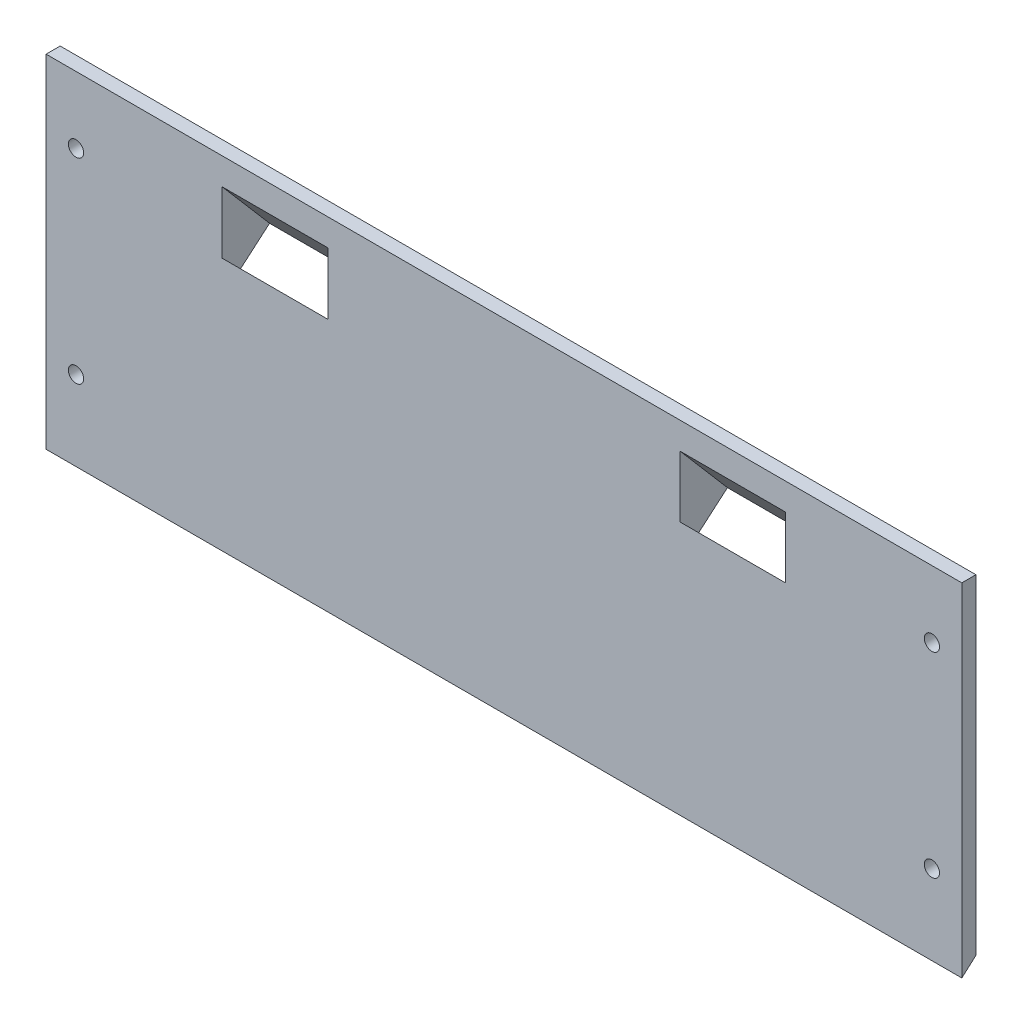
ISO-10303-21;
HEADER;
FILE_DESCRIPTION(('STEP AP214'),'2;1');
FILE_NAME('part.step','',(''),(''),'','','');
FILE_SCHEMA(('AUTOMOTIVE_DESIGN { 1 0 10303 214 1 1 1 1 }'));
ENDSEC;
DATA;
#1=APPLICATION_CONTEXT('core data for automotive mechanical design processes');
#2=APPLICATION_PROTOCOL_DEFINITION('international standard','automotive_design',2000,#1);
#3=PRODUCT_CONTEXT('',#1,'mechanical');
#4=PRODUCT('Part','Part','',(#3));
#5=PRODUCT_RELATED_PRODUCT_CATEGORY('part','',(#4));
#6=PRODUCT_DEFINITION_FORMATION('','',#4);
#7=PRODUCT_DEFINITION_CONTEXT('part definition',#1,'design');
#8=PRODUCT_DEFINITION('design','',#6,#7);
#9=PRODUCT_DEFINITION_SHAPE('','',#8);
#10=(LENGTH_UNIT() NAMED_UNIT(*) SI_UNIT(.MILLI.,.METRE.));
#11=(NAMED_UNIT(*) PLANE_ANGLE_UNIT() SI_UNIT($,.RADIAN.));
#12=(NAMED_UNIT(*) SI_UNIT($,.STERADIAN.) SOLID_ANGLE_UNIT());
#13=UNCERTAINTY_MEASURE_WITH_UNIT(LENGTH_MEASURE(1.E-05),#10,'distance_accuracy_value','');
#14=(GEOMETRIC_REPRESENTATION_CONTEXT(3) GLOBAL_UNCERTAINTY_ASSIGNED_CONTEXT((#13)) GLOBAL_UNIT_ASSIGNED_CONTEXT((#10,
#11,#12)) REPRESENTATION_CONTEXT('',''));
#15=CARTESIAN_POINT('',(0.,0.,0.));
#16=DIRECTION('',(0.,0.,1.));
#17=DIRECTION('',(1.,0.,0.));
#18=AXIS2_PLACEMENT_3D('',#15,#16,#17);
#19=CARTESIAN_POINT('',(0.,0.,0.));
#20=DIRECTION('',(0.,0.,1.));
#21=DIRECTION('',(1.,0.,0.));
#22=AXIS2_PLACEMENT_3D('',#19,#20,#21);
#23=PLANE('',#22);
#24=DIRECTION('',(0.,-1.,0.));
#25=VECTOR('',#24,1.);
#26=CARTESIAN_POINT('',(-97.5,0.,0.));
#27=LINE('',#26,#25);
#28=CARTESIAN_POINT('',(-97.5,43.,0.));
#29=VERTEX_POINT('',#28);
#30=CARTESIAN_POINT('',(-97.5,-27.2007247423312,0.));
#31=VERTEX_POINT('',#30);
#32=EDGE_CURVE('E285',#29,#31,#27,.T.);
#33=ORIENTED_EDGE('',*,*,#32,.F.);
#34=DIRECTION('',(-1.,0.,0.));
#35=VECTOR('',#34,1.);
#36=CARTESIAN_POINT('',(97.5,43.,0.));
#37=LINE('',#36,#35);
#38=CARTESIAN_POINT('',(97.5,43.,0.));
#39=VERTEX_POINT('',#38);
#40=EDGE_CURVE('E160',#39,#29,#37,.T.);
#41=ORIENTED_EDGE('',*,*,#40,.F.);
#42=DIRECTION('',(0.,1.,0.));
#43=VECTOR('',#42,1.);
#44=CARTESIAN_POINT('',(97.5,0.,0.));
#45=LINE('',#44,#43);
#46=CARTESIAN_POINT('',(97.5,-27.2007247423312,0.));
#47=VERTEX_POINT('',#46);
#48=EDGE_CURVE('E283',#47,#39,#45,.T.);
#49=ORIENTED_EDGE('',*,*,#48,.F.);
#50=DIRECTION('',(-1.,0.,0.));
#51=VECTOR('',#50,1.);
#52=CARTESIAN_POINT('',(-84.75,-27.2007247423312,0.));
#53=LINE('',#52,#51);
#54=EDGE_CURVE('E481',#47,#31,#53,.T.);
#55=ORIENTED_EDGE('',*,*,#54,.T.);
#56=EDGE_LOOP('',(#33,#41,#49,#55));
#57=FACE_BOUND('',#56,.T.);
#58=CARTESIAN_POINT('',(91.125,28.7992752576688,0.));
#59=DIRECTION('',(0.,0.,1.));
#60=DIRECTION('',(1.,0.,0.));
#61=AXIS2_PLACEMENT_3D('',#58,#59,#60);
#62=CIRCLE('',#61,1.625);
#63=CARTESIAN_POINT('',(92.75,28.7992752576688,0.));
#64=VERTEX_POINT('',#63);
#65=EDGE_CURVE('E519',#64,#64,#62,.T.);
#66=ORIENTED_EDGE('',*,*,#65,.T.);
#67=EDGE_LOOP('',(#66));
#68=FACE_BOUND('',#67,.T.);
#69=CARTESIAN_POINT('',(91.125,-12.8907247423312,0.));
#70=DIRECTION('',(0.,0.,1.));
#71=DIRECTION('',(1.,0.,0.));
#72=AXIS2_PLACEMENT_3D('',#69,#70,#71);
#73=CIRCLE('',#72,1.625);
#74=CARTESIAN_POINT('',(92.75,-12.8907247423312,0.));
#75=VERTEX_POINT('',#74);
#76=EDGE_CURVE('E515',#75,#75,#73,.T.);
#77=ORIENTED_EDGE('',*,*,#76,.T.);
#78=EDGE_LOOP('',(#77));
#79=FACE_BOUND('',#78,.T.);
#80=CARTESIAN_POINT('',(-91.125,-12.8907247423312,0.));
#81=DIRECTION('',(0.,0.,1.));
#82=DIRECTION('',(1.,0.,0.));
#83=AXIS2_PLACEMENT_3D('',#80,#81,#82);
#84=CIRCLE('',#83,1.625);
#85=CARTESIAN_POINT('',(-89.5,-12.8907247423312,0.));
#86=VERTEX_POINT('',#85);
#87=EDGE_CURVE('E511',#86,#86,#84,.T.);
#88=ORIENTED_EDGE('',*,*,#87,.T.);
#89=EDGE_LOOP('',(#88));
#90=FACE_BOUND('',#89,.T.);
#91=CARTESIAN_POINT('',(-91.125,28.7992752576688,0.));
#92=DIRECTION('',(0.,0.,1.));
#93=DIRECTION('',(1.,0.,0.));
#94=AXIS2_PLACEMENT_3D('',#91,#92,#93);
#95=CIRCLE('',#94,1.625);
#96=CARTESIAN_POINT('',(-89.5,28.7992752576688,0.));
#97=VERTEX_POINT('',#96);
#98=EDGE_CURVE('E507',#97,#97,#95,.T.);
#99=ORIENTED_EDGE('',*,*,#98,.T.);
#100=EDGE_LOOP('',(#99));
#101=FACE_BOUND('',#100,.T.);
#102=DIRECTION('',(-1.,0.,0.));
#103=VECTOR('',#102,1.);
#104=CARTESIAN_POINT('',(-27.5,19.4365301047442,0.));
#105=LINE('',#104,#103);
#106=CARTESIAN_POINT('',(-27.5,19.4365301047442,0.));
#107=VERTEX_POINT('',#106);
#108=CARTESIAN_POINT('',(-62.5,19.4365301047442,0.));
#109=VERTEX_POINT('',#108);
#110=EDGE_CURVE('E382',#107,#109,#105,.T.);
#111=ORIENTED_EDGE('',*,*,#110,.F.);
#112=DIRECTION('',(0.,1.,0.));
#113=VECTOR('',#112,1.);
#114=CARTESIAN_POINT('',(-27.5,35.3168437418942,0.));
#115=LINE('',#114,#113);
#116=CARTESIAN_POINT('',(-27.5,35.3168437418942,0.));
#117=VERTEX_POINT('',#116);
#118=EDGE_CURVE('E359',#107,#117,#115,.T.);
#119=ORIENTED_EDGE('',*,*,#118,.T.);
#120=DIRECTION('',(-1.,0.,0.));
#121=VECTOR('',#120,1.);
#122=CARTESIAN_POINT('',(-27.5,35.3168437418942,0.));
#123=LINE('',#122,#121);
#124=CARTESIAN_POINT('',(-62.5,35.3168437418942,0.));
#125=VERTEX_POINT('',#124);
#126=EDGE_CURVE('E371',#117,#125,#123,.T.);
#127=ORIENTED_EDGE('',*,*,#126,.T.);
#128=DIRECTION('',(0.,1.,0.));
#129=VECTOR('',#128,1.);
#130=CARTESIAN_POINT('',(-62.5,35.3168437418942,0.));
#131=LINE('',#130,#129);
#132=EDGE_CURVE('E358',#109,#125,#131,.T.);
#133=ORIENTED_EDGE('',*,*,#132,.F.);
#134=EDGE_LOOP('',(#111,#119,#127,#133));
#135=FACE_BOUND('',#134,.T.);
#136=DIRECTION('',(0.,-1.,0.));
#137=VECTOR('',#136,1.);
#138=CARTESIAN_POINT('',(27.5,35.3168437418942,0.));
#139=LINE('',#138,#137);
#140=CARTESIAN_POINT('',(27.5,35.3168437418942,0.));
#141=VERTEX_POINT('',#140);
#142=CARTESIAN_POINT('',(27.5,19.4365301047442,0.));
#143=VERTEX_POINT('',#142);
#144=EDGE_CURVE('E298',#141,#143,#139,.T.);
#145=ORIENTED_EDGE('',*,*,#144,.T.);
#146=DIRECTION('',(1.,0.,0.));
#147=VECTOR('',#146,1.);
#148=CARTESIAN_POINT('',(-97.501,19.4365301047442,0.));
#149=LINE('',#148,#147);
#150=CARTESIAN_POINT('',(62.5,19.4365301047442,0.));
#151=VERTEX_POINT('',#150);
#152=EDGE_CURVE('E404',#143,#151,#149,.T.);
#153=ORIENTED_EDGE('',*,*,#152,.T.);
#154=DIRECTION('',(0.,-1.,0.));
#155=VECTOR('',#154,1.);
#156=CARTESIAN_POINT('',(62.5,35.3168437418942,0.));
#157=LINE('',#156,#155);
#158=CARTESIAN_POINT('',(62.5,35.3168437418942,0.));
#159=VERTEX_POINT('',#158);
#160=EDGE_CURVE('E457',#159,#151,#157,.T.);
#161=ORIENTED_EDGE('',*,*,#160,.F.);
#162=DIRECTION('',(1.,0.,0.));
#163=VECTOR('',#162,1.);
#164=CARTESIAN_POINT('',(27.5,35.3168437418942,0.));
#165=LINE('',#164,#163);
#166=EDGE_CURVE('E291',#141,#159,#165,.T.);
#167=ORIENTED_EDGE('',*,*,#166,.F.);
#168=EDGE_LOOP('',(#145,#153,#161,#167));
#169=FACE_BOUND('',#168,.T.);
#170=ADVANCED_FACE('F144',(#57,#68,#79,#90,#101,#135,#169),#23,.F.);
#171=CARTESIAN_POINT('',(0.,0.,3.));
#172=DIRECTION('',(0.,0.,1.));
#173=DIRECTION('',(1.,0.,0.));
#174=AXIS2_PLACEMENT_3D('',#171,#172,#173);
#175=PLANE('',#174);
#176=DIRECTION('',(-1.,0.,0.));
#177=VECTOR('',#176,1.);
#178=CARTESIAN_POINT('',(97.5,43.,3.));
#179=LINE('',#178,#177);
#180=CARTESIAN_POINT('',(97.5,43.,3.));
#181=VERTEX_POINT('',#180);
#182=CARTESIAN_POINT('',(-97.5,43.,3.));
#183=VERTEX_POINT('',#182);
#184=EDGE_CURVE('E271',#181,#183,#179,.T.);
#185=ORIENTED_EDGE('',*,*,#184,.T.);
#186=DIRECTION('',(0.,-1.,0.));
#187=VECTOR('',#186,1.);
#188=CARTESIAN_POINT('',(-97.5,0.,3.));
#189=LINE('',#188,#187);
#190=CARTESIAN_POINT('',(-97.5,-29.8738129934953,3.));
#191=VERTEX_POINT('',#190);
#192=EDGE_CURVE('E301',#183,#191,#189,.T.);
#193=ORIENTED_EDGE('',*,*,#192,.T.);
#194=DIRECTION('',(1.,0.,0.));
#195=VECTOR('',#194,1.);
#196=CARTESIAN_POINT('',(0.,-29.8738129934953,3.));
#197=LINE('',#196,#195);
#198=CARTESIAN_POINT('',(97.5,-29.8738129934953,3.));
#199=VERTEX_POINT('',#198);
#200=EDGE_CURVE('E473',#191,#199,#197,.T.);
#201=ORIENTED_EDGE('',*,*,#200,.T.);
#202=DIRECTION('',(0.,1.,0.));
#203=VECTOR('',#202,1.);
#204=CARTESIAN_POINT('',(97.5,0.,3.));
#205=LINE('',#204,#203);
#206=EDGE_CURVE('E295',#199,#181,#205,.T.);
#207=ORIENTED_EDGE('',*,*,#206,.T.);
#208=EDGE_LOOP('',(#185,#193,#201,#207));
#209=FACE_BOUND('',#208,.T.);
#210=CARTESIAN_POINT('',(91.125,28.7992752576688,3.));
#211=DIRECTION('',(0.,0.,1.));
#212=DIRECTION('',(-1.,0.,0.));
#213=AXIS2_PLACEMENT_3D('',#210,#211,#212);
#214=CIRCLE('',#213,1.625);
#215=CARTESIAN_POINT('',(89.5,28.7992752576688,3.));
#216=VERTEX_POINT('',#215);
#217=EDGE_CURVE('E491',#216,#216,#214,.T.);
#218=ORIENTED_EDGE('',*,*,#217,.F.);
#219=EDGE_LOOP('',(#218));
#220=FACE_BOUND('',#219,.T.);
#221=CARTESIAN_POINT('',(91.125,-12.8907247423312,3.));
#222=DIRECTION('',(0.,0.,1.));
#223=DIRECTION('',(-1.,0.,0.));
#224=AXIS2_PLACEMENT_3D('',#221,#222,#223);
#225=CIRCLE('',#224,1.625);
#226=CARTESIAN_POINT('',(89.5,-12.8907247423312,3.));
#227=VERTEX_POINT('',#226);
#228=EDGE_CURVE('E497',#227,#227,#225,.T.);
#229=ORIENTED_EDGE('',*,*,#228,.F.);
#230=EDGE_LOOP('',(#229));
#231=FACE_BOUND('',#230,.T.);
#232=CARTESIAN_POINT('',(-91.125,-12.8907247423312,3.));
#233=DIRECTION('',(0.,0.,1.));
#234=DIRECTION('',(1.,0.,0.));
#235=AXIS2_PLACEMENT_3D('',#232,#233,#234);
#236=CIRCLE('',#235,1.625);
#237=CARTESIAN_POINT('',(-89.5,-12.8907247423312,3.));
#238=VERTEX_POINT('',#237);
#239=EDGE_CURVE('E492',#238,#238,#236,.T.);
#240=ORIENTED_EDGE('',*,*,#239,.F.);
#241=EDGE_LOOP('',(#240));
#242=FACE_BOUND('',#241,.T.);
#243=CARTESIAN_POINT('',(-91.125,28.7992752576688,3.));
#244=DIRECTION('',(0.,0.,1.));
#245=DIRECTION('',(1.,0.,0.));
#246=AXIS2_PLACEMENT_3D('',#243,#244,#245);
#247=CIRCLE('',#246,1.625);
#248=CARTESIAN_POINT('',(-89.5,28.7992752576688,3.));
#249=VERTEX_POINT('',#248);
#250=EDGE_CURVE('E496',#249,#249,#247,.T.);
#251=ORIENTED_EDGE('',*,*,#250,.F.);
#252=EDGE_LOOP('',(#251));
#253=FACE_BOUND('',#252,.T.);
#254=DIRECTION('',(0.,1.,0.));
#255=VECTOR('',#254,1.);
#256=CARTESIAN_POINT('',(-37.5,0.,3.));
#257=LINE('',#256,#255);
#258=CARTESIAN_POINT('',(-37.5,24.1079482702204,3.00000000000003));
#259=VERTEX_POINT('',#258);
#260=CARTESIAN_POINT('',(-37.5,37.2803725482032,3.));
#261=VERTEX_POINT('',#260);
#262=EDGE_CURVE('E328',#259,#261,#257,.T.);
#263=ORIENTED_EDGE('',*,*,#262,.F.);
#264=DIRECTION('',(1.,0.,0.));
#265=VECTOR('',#264,1.);
#266=CARTESIAN_POINT('',(1.41884106913911E-13,24.1079482702201,3.));
#267=LINE('',#266,#265);
#268=CARTESIAN_POINT('',(-60.,24.1079482702205,3.));
#269=VERTEX_POINT('',#268);
#270=EDGE_CURVE('E330',#269,#259,#267,.T.);
#271=ORIENTED_EDGE('',*,*,#270,.F.);
#272=DIRECTION('',(0.,-1.,0.));
#273=VECTOR('',#272,1.);
#274=CARTESIAN_POINT('',(-60.,0.,3.));
#275=LINE('',#274,#273);
#276=CARTESIAN_POINT('',(-60.,37.2803725482032,3.));
#277=VERTEX_POINT('',#276);
#278=EDGE_CURVE('E339',#277,#269,#275,.T.);
#279=ORIENTED_EDGE('',*,*,#278,.F.);
#280=DIRECTION('',(-1.,0.,0.));
#281=VECTOR('',#280,1.);
#282=CARTESIAN_POINT('',(0.,37.2803725482032,3.));
#283=LINE('',#282,#281);
#284=EDGE_CURVE('E353',#261,#277,#283,.T.);
#285=ORIENTED_EDGE('',*,*,#284,.F.);
#286=EDGE_LOOP('',(#263,#271,#279,#285));
#287=FACE_BOUND('',#286,.T.);
#288=DIRECTION('',(0.,-1.,0.));
#289=VECTOR('',#288,1.);
#290=CARTESIAN_POINT('',(37.5,0.,3.));
#291=LINE('',#290,#289);
#292=CARTESIAN_POINT('',(37.5,37.2803725482032,3.));
#293=VERTEX_POINT('',#292);
#294=CARTESIAN_POINT('',(37.5,24.2190069094234,3.));
#295=VERTEX_POINT('',#294);
#296=EDGE_CURVE('E450',#293,#295,#291,.T.);
#297=ORIENTED_EDGE('',*,*,#296,.F.);
#298=DIRECTION('',(-1.,0.,0.));
#299=VECTOR('',#298,1.);
#300=CARTESIAN_POINT('',(0.,37.2803725482032,3.));
#301=LINE('',#300,#299);
#302=CARTESIAN_POINT('',(60.,37.2803725482032,3.));
#303=VERTEX_POINT('',#302);
#304=EDGE_CURVE('E429',#303,#293,#301,.T.);
#305=ORIENTED_EDGE('',*,*,#304,.F.);
#306=DIRECTION('',(0.,1.,0.));
#307=VECTOR('',#306,1.);
#308=CARTESIAN_POINT('',(60.,0.,3.));
#309=LINE('',#308,#307);
#310=CARTESIAN_POINT('',(60.,24.2190069094234,3.));
#311=VERTEX_POINT('',#310);
#312=EDGE_CURVE('E443',#311,#303,#309,.T.);
#313=ORIENTED_EDGE('',*,*,#312,.F.);
#314=DIRECTION('',(1.,0.,0.));
#315=VECTOR('',#314,1.);
#316=CARTESIAN_POINT('',(0.,24.2190069094234,3.));
#317=LINE('',#316,#315);
#318=EDGE_CURVE('E447',#295,#311,#317,.T.);
#319=ORIENTED_EDGE('',*,*,#318,.F.);
#320=EDGE_LOOP('',(#297,#305,#313,#319));
#321=FACE_BOUND('',#320,.T.);
#322=ADVANCED_FACE('F471',(#209,#220,#231,#242,#253,#287,#321),#175,.T.);
#323=CARTESIAN_POINT('',(97.5,0.,3.));
#324=DIRECTION('',(-1.,0.,0.));
#325=DIRECTION('',(0.,0.,1.));
#326=AXIS2_PLACEMENT_3D('',#323,#324,#325);
#327=PLANE('',#326);
#328=ORIENTED_EDGE('',*,*,#48,.T.);
#329=DIRECTION('',(0.,0.,1.));
#330=VECTOR('',#329,1.);
#331=CARTESIAN_POINT('',(97.5,43.,3.));
#332=LINE('',#331,#330);
#333=EDGE_CURVE('E268',#39,#181,#332,.T.);
#334=ORIENTED_EDGE('',*,*,#333,.T.);
#335=ORIENTED_EDGE('',*,*,#206,.F.);
#336=DIRECTION('',(0.,-0.665256125047226,0.746615220905085));
#337=VECTOR('',#336,1.);
#338=CARTESIAN_POINT('',(97.5,-27.2007247423312,0.));
#339=LINE('',#338,#337);
#340=EDGE_CURVE('E289',#47,#199,#339,.T.);
#341=ORIENTED_EDGE('',*,*,#340,.F.);
#342=EDGE_LOOP('',(#328,#334,#335,#341));
#343=FACE_BOUND('',#342,.T.);
#344=ADVANCED_FACE('F146',(#343),#327,.F.);
#345=CARTESIAN_POINT('',(-97.5,0.,3.));
#346=DIRECTION('',(1.,0.,0.));
#347=DIRECTION('',(0.,0.,-1.));
#348=AXIS2_PLACEMENT_3D('',#345,#346,#347);
#349=PLANE('',#348);
#350=ORIENTED_EDGE('',*,*,#192,.F.);
#351=DIRECTION('',(0.,0.,1.));
#352=VECTOR('',#351,1.);
#353=CARTESIAN_POINT('',(-97.5,43.,3.));
#354=LINE('',#353,#352);
#355=EDGE_CURVE('E277',#29,#183,#354,.T.);
#356=ORIENTED_EDGE('',*,*,#355,.F.);
#357=ORIENTED_EDGE('',*,*,#32,.T.);
#358=DIRECTION('',(0.,0.665256125047226,-0.746615220905086));
#359=VECTOR('',#358,1.);
#360=CARTESIAN_POINT('',(-97.5,-16.6526876784777,-11.838034594548));
#361=LINE('',#360,#359);
#362=EDGE_CURVE('E479',#191,#31,#361,.T.);
#363=ORIENTED_EDGE('',*,*,#362,.F.);
#364=EDGE_LOOP('',(#350,#356,#357,#363));
#365=FACE_BOUND('',#364,.T.);
#366=ADVANCED_FACE('F483',(#365),#349,.F.);
#367=CARTESIAN_POINT('',(27.5,35.3168437418942,0.));
#368=DIRECTION('',(0.,0.650774217265853,-0.759271307334879));
#369=DIRECTION('',(0.,0.759271307334879,0.650774217265853));
#370=AXIS2_PLACEMENT_3D('',#367,#368,#369);
#371=PLANE('',#370);
#372=DIRECTION('',(1.,0.,0.));
#373=VECTOR('',#372,1.);
#374=CARTESIAN_POINT('',(-97.501,26.1619553922032,-7.8466883212522));
#375=LINE('',#374,#373);
#376=CARTESIAN_POINT('',(27.5,26.1619553922032,-7.8466883212522));
#377=VERTEX_POINT('',#376);
#378=CARTESIAN_POINT('',(62.5,26.1619553922032,-7.8466883212522));
#379=VERTEX_POINT('',#378);
#380=EDGE_CURVE('E403',#377,#379,#375,.T.);
#381=ORIENTED_EDGE('',*,*,#380,.F.);
#382=DIRECTION('',(0.,0.759271307334879,0.650774217265853));
#383=VECTOR('',#382,1.);
#384=CARTESIAN_POINT('',(27.5,35.3168437418942,0.));
#385=LINE('',#384,#383);
#386=EDGE_CURVE('E454',#377,#141,#385,.T.);
#387=ORIENTED_EDGE('',*,*,#386,.T.);
#388=ORIENTED_EDGE('',*,*,#166,.T.);
#389=DIRECTION('',(0.,0.759271307334879,0.650774217265853));
#390=VECTOR('',#389,1.);
#391=CARTESIAN_POINT('',(62.5,35.3168437418942,0.));
#392=LINE('',#391,#390);
#393=EDGE_CURVE('E453',#379,#159,#392,.T.);
#394=ORIENTED_EDGE('',*,*,#393,.F.);
#395=EDGE_LOOP('',(#381,#387,#388,#394));
#396=FACE_BOUND('',#395,.T.);
#397=ADVANCED_FACE('F557',(#396),#371,.T.);
#398=CARTESIAN_POINT('',(27.5,0.,0.));
#399=DIRECTION('',(1.,0.,0.));
#400=DIRECTION('',(0.,0.,-1.));
#401=AXIS2_PLACEMENT_3D('',#398,#399,#400);
#402=PLANE('',#401);
#403=ORIENTED_EDGE('',*,*,#386,.F.);
#404=DIRECTION('',(0.,0.650774217265853,-0.759271307334879));
#405=VECTOR('',#404,1.);
#406=CARTESIAN_POINT('',(27.5,19.4365301047442,0.));
#407=LINE('',#406,#405);
#408=EDGE_CURVE('E421',#143,#377,#407,.T.);
#409=ORIENTED_EDGE('',*,*,#408,.F.);
#410=ORIENTED_EDGE('',*,*,#144,.F.);
#411=EDGE_LOOP('',(#403,#409,#410));
#412=FACE_BOUND('',#411,.T.);
#413=ADVANCED_FACE('F563',(#412),#402,.F.);
#414=CARTESIAN_POINT('',(62.5,0.,0.));
#415=DIRECTION('',(1.,0.,0.));
#416=DIRECTION('',(0.,0.,-1.));
#417=AXIS2_PLACEMENT_3D('',#414,#415,#416);
#418=PLANE('',#417);
#419=DIRECTION('',(0.,-0.650774217265853,0.759271307334879));
#420=VECTOR('',#419,1.);
#421=CARTESIAN_POINT('',(62.5,19.4365301047442,0.));
#422=LINE('',#421,#420);
#423=EDGE_CURVE('E396',#379,#151,#422,.T.);
#424=ORIENTED_EDGE('',*,*,#423,.F.);
#425=ORIENTED_EDGE('',*,*,#393,.T.);
#426=ORIENTED_EDGE('',*,*,#160,.T.);
#427=EDGE_LOOP('',(#424,#425,#426));
#428=FACE_BOUND('',#427,.T.);
#429=ADVANCED_FACE('F703',(#428),#418,.T.);
#430=CARTESIAN_POINT('',(37.5,35.046116421815,12.2799552019297));
#431=DIRECTION('',(-1.,0.,0.));
#432=DIRECTION('',(0.,0.,1.));
#433=AXIS2_PLACEMENT_3D('',#430,#431,#432);
#434=PLANE('',#433);
#435=DIRECTION('',(0.,-0.75927130733488,-0.650774217265852));
#436=VECTOR('',#435,1.);
#437=CARTESIAN_POINT('',(37.5,35.046116421815,12.2799552019297));
#438=LINE('',#437,#436);
#439=CARTESIAN_POINT('',(37.5,19.9796003281776,-0.633610901570863));
#440=VERTEX_POINT('',#439);
#441=EDGE_CURVE('E425',#295,#440,#438,.T.);
#442=ORIENTED_EDGE('',*,*,#441,.T.);
#443=DIRECTION('',(0.,-0.650774217265853,0.759271307334879));
#444=VECTOR('',#443,1.);
#445=CARTESIAN_POINT('',(37.5,19.4365301047441,0.));
#446=LINE('',#445,#444);
#447=CARTESIAN_POINT('',(37.5,25.5111811749373,-7.08741701391733));
#448=VERTEX_POINT('',#447);
#449=EDGE_CURVE('E418',#448,#440,#446,.T.);
#450=ORIENTED_EDGE('',*,*,#449,.F.);
#451=DIRECTION('',(0.,-0.75927130733488,-0.650774217265852));
#452=VECTOR('',#451,1.);
#453=CARTESIAN_POINT('',(37.5,40.5776972685747,5.82614908958319));
#454=LINE('',#453,#452);
#455=EDGE_CURVE('E424',#293,#448,#454,.T.);
#456=ORIENTED_EDGE('',*,*,#455,.F.);
#457=ORIENTED_EDGE('',*,*,#296,.T.);
#458=EDGE_LOOP('',(#442,#450,#456,#457));
#459=FACE_BOUND('',#458,.T.);
#460=ADVANCED_FACE('F705',(#459),#434,.F.);
#461=CARTESIAN_POINT('',(60.,35.046116421815,12.2799552019297));
#462=DIRECTION('',(0.,-0.650774217265852,0.75927130733488));
#463=DIRECTION('',(0.,-0.75927130733488,-0.650774217265852));
#464=AXIS2_PLACEMENT_3D('',#461,#462,#463);
#465=PLANE('',#464);
#466=DIRECTION('',(0.,-0.75927130733488,-0.650774217265852));
#467=VECTOR('',#466,1.);
#468=CARTESIAN_POINT('',(60.,35.046116421815,12.2799552019297));
#469=LINE('',#468,#467);
#470=CARTESIAN_POINT('',(60.,19.9796003281776,-0.633610901570861));
#471=VERTEX_POINT('',#470);
#472=EDGE_CURVE('E430',#311,#471,#469,.T.);
#473=ORIENTED_EDGE('',*,*,#472,.T.);
#474=DIRECTION('',(1.,0.,0.));
#475=VECTOR('',#474,1.);
#476=CARTESIAN_POINT('',(-97.501,19.9796003281776,-0.633610901570869));
#477=LINE('',#476,#475);
#478=EDGE_CURVE('E415',#440,#471,#477,.T.);
#479=ORIENTED_EDGE('',*,*,#478,.F.);
#480=ORIENTED_EDGE('',*,*,#441,.F.);
#481=ORIENTED_EDGE('',*,*,#318,.T.);
#482=EDGE_LOOP('',(#473,#479,#480,#481));
#483=FACE_BOUND('',#482,.T.);
#484=ADVANCED_FACE('F711',(#483),#465,.F.);
#485=CARTESIAN_POINT('',(60.,40.5776972685747,5.82614908958319));
#486=DIRECTION('',(1.,0.,0.));
#487=DIRECTION('',(0.,0.,-1.));
#488=AXIS2_PLACEMENT_3D('',#485,#486,#487);
#489=PLANE('',#488);
#490=DIRECTION('',(0.,-0.75927130733488,-0.650774217265852));
#491=VECTOR('',#490,1.);
#492=CARTESIAN_POINT('',(60.,40.5776972685747,5.82614908958319));
#493=LINE('',#492,#491);
#494=CARTESIAN_POINT('',(60.,25.5111811749373,-7.08741701391733));
#495=VERTEX_POINT('',#494);
#496=EDGE_CURVE('E434',#303,#495,#493,.T.);
#497=ORIENTED_EDGE('',*,*,#496,.T.);
#498=DIRECTION('',(0.,0.650774217265853,-0.759271307334879));
#499=VECTOR('',#498,1.);
#500=CARTESIAN_POINT('',(60.,19.4365301047442,0.));
#501=LINE('',#500,#499);
#502=EDGE_CURVE('E412',#471,#495,#501,.T.);
#503=ORIENTED_EDGE('',*,*,#502,.F.);
#504=ORIENTED_EDGE('',*,*,#472,.F.);
#505=ORIENTED_EDGE('',*,*,#312,.T.);
#506=EDGE_LOOP('',(#497,#503,#504,#505));
#507=FACE_BOUND('',#506,.T.);
#508=ADVANCED_FACE('F719',(#507),#489,.F.);
#509=CARTESIAN_POINT('',(37.5,40.5776972685747,5.82614908958319));
#510=DIRECTION('',(0.,0.650774217265852,-0.75927130733488));
#511=DIRECTION('',(0.,0.75927130733488,0.650774217265852));
#512=AXIS2_PLACEMENT_3D('',#509,#510,#511);
#513=PLANE('',#512);
#514=ORIENTED_EDGE('',*,*,#455,.T.);
#515=DIRECTION('',(-1.,0.,0.));
#516=VECTOR('',#515,1.);
#517=CARTESIAN_POINT('',(-97.501,25.5111811749373,-7.08741701391733));
#518=LINE('',#517,#516);
#519=EDGE_CURVE('E407',#495,#448,#518,.T.);
#520=ORIENTED_EDGE('',*,*,#519,.F.);
#521=ORIENTED_EDGE('',*,*,#496,.F.);
#522=ORIENTED_EDGE('',*,*,#304,.T.);
#523=EDGE_LOOP('',(#514,#520,#521,#522));
#524=FACE_BOUND('',#523,.T.);
#525=ADVANCED_FACE('F716',(#524),#513,.F.);
#526=CARTESIAN_POINT('',(-97.501,19.4365301047442,0.));
#527=DIRECTION('',(0.,0.759271307334879,0.650774217265853));
#528=DIRECTION('',(0.,-0.650774217265853,0.759271307334879));
#529=AXIS2_PLACEMENT_3D('',#526,#527,#528);
#530=PLANE('',#529);
#531=CARTESIAN_POINT('',(33.75,22.8039604311114,-3.92884837540423));
#532=DIRECTION('',(0.,-0.759271307334879,-0.650774217265853));
#533=DIRECTION('',(0.,0.650774217265853,-0.759271307334879));
#534=AXIS2_PLACEMENT_3D('',#531,#532,#533);
#535=CIRCLE('',#534,0.999999999999998);
#536=CARTESIAN_POINT('',(33.75,23.4547346483772,-4.6881196827391));
#537=VERTEX_POINT('',#536);
#538=EDGE_CURVE('E386',#537,#537,#535,.T.);
#539=ORIENTED_EDGE('',*,*,#538,.F.);
#540=EDGE_LOOP('',(#539));
#541=FACE_BOUND('',#540,.T.);
#542=ORIENTED_EDGE('',*,*,#449,.T.);
#543=ORIENTED_EDGE('',*,*,#478,.T.);
#544=ORIENTED_EDGE('',*,*,#502,.T.);
#545=ORIENTED_EDGE('',*,*,#519,.T.);
#546=EDGE_LOOP('',(#542,#543,#544,#545));
#547=FACE_BOUND('',#546,.T.);
#548=ORIENTED_EDGE('',*,*,#408,.T.);
#549=ORIENTED_EDGE('',*,*,#380,.T.);
#550=ORIENTED_EDGE('',*,*,#423,.T.);
#551=ORIENTED_EDGE('',*,*,#152,.F.);
#552=EDGE_LOOP('',(#548,#549,#550,#551));
#553=FACE_BOUND('',#552,.T.);
#554=ADVANCED_FACE('F699',(#541,#547,#553),#530,.F.);
#555=CARTESIAN_POINT('',(33.75,26.6003169677858,-0.674977289074958));
#556=DIRECTION('',(0.,-0.759271307334879,-0.650774217265853));
#557=DIRECTION('',(0.,0.650774217265853,-0.759271307334879));
#558=AXIS2_PLACEMENT_3D('',#555,#556,#557);
#559=CYLINDRICAL_SURFACE('',#558,0.999999999999998);
#560=CARTESIAN_POINT('',(33.75,26.6003169677858,-0.674977289074958));
#561=DIRECTION('',(0.,-0.759271307334879,-0.650774217265853));
#562=DIRECTION('',(0.,0.650774217265853,-0.759271307334879));
#563=AXIS2_PLACEMENT_3D('',#560,#561,#562);
#564=CIRCLE('',#563,0.999999999999998);
#565=CARTESIAN_POINT('',(33.75,27.2510911850516,-1.43424859640984));
#566=VERTEX_POINT('',#565);
#567=EDGE_CURVE('E392',#566,#566,#564,.T.);
#568=ORIENTED_EDGE('',*,*,#567,.F.);
#569=EDGE_LOOP('',(#568));
#570=FACE_BOUND('',#569,.T.);
#571=ORIENTED_EDGE('',*,*,#538,.T.);
#572=EDGE_LOOP('',(#571));
#573=FACE_BOUND('',#572,.T.);
#574=ADVANCED_FACE('F544',(#570,#573),#559,.F.);
#575=CARTESIAN_POINT('',(33.75,26.6003169677858,-0.674977289074958));
#576=DIRECTION('',(0.,-0.759271307334879,-0.650774217265853));
#577=DIRECTION('',(0.,0.650774217265853,-0.759271307334879));
#578=AXIS2_PLACEMENT_3D('',#575,#576,#577);
#579=PLANE('',#578);
#580=ORIENTED_EDGE('',*,*,#567,.T.);
#581=EDGE_LOOP('',(#580));
#582=FACE_BOUND('',#581,.T.);
#583=ADVANCED_FACE('F535',(#582),#579,.T.);
#584=CARTESIAN_POINT('',(-27.5,19.4365301047442,0.));
#585=DIRECTION('',(0.,-0.759271307334879,-0.650774217265853));
#586=DIRECTION('',(0.,0.650774217265853,-0.759271307334879));
#587=AXIS2_PLACEMENT_3D('',#584,#585,#586);
#588=PLANE('',#587);
#589=CARTESIAN_POINT('',(-33.75,22.8039604311114,-3.92884837540422));
#590=DIRECTION('',(0.,-0.759271307334879,-0.650774217265853));
#591=DIRECTION('',(0.,-0.650774217265853,0.759271307334879));
#592=AXIS2_PLACEMENT_3D('',#589,#590,#591);
#593=CIRCLE('',#592,0.999999999999991);
#594=CARTESIAN_POINT('',(-33.75,22.1531862138455,-3.16957706806935));
#595=VERTEX_POINT('',#594);
#596=EDGE_CURVE('E523',#595,#595,#593,.T.);
#597=ORIENTED_EDGE('',*,*,#596,.F.);
#598=EDGE_LOOP('',(#597));
#599=FACE_BOUND('',#598,.T.);
#600=DIRECTION('',(0.,-0.650774217265853,0.759271307334879));
#601=VECTOR('',#600,1.);
#602=CARTESIAN_POINT('',(-37.5,19.4365301047442,0.));
#603=LINE('',#602,#601);
#604=CARTESIAN_POINT('',(-37.5,25.5111811749373,-7.08741701391734));
#605=VERTEX_POINT('',#604);
#606=CARTESIAN_POINT('',(-37.5,19.9325662079736,-0.578735251938216));
#607=VERTEX_POINT('',#606);
#608=EDGE_CURVE('E12',#605,#607,#603,.T.);
#609=ORIENTED_EDGE('',*,*,#608,.F.);
#610=DIRECTION('',(1.,0.,0.));
#611=VECTOR('',#610,1.);
#612=CARTESIAN_POINT('',(-27.5,25.5111811749373,-7.08741701391734));
#613=LINE('',#612,#611);
#614=CARTESIAN_POINT('',(-60.,25.5111811749373,-7.08741701391734));
#615=VERTEX_POINT('',#614);
#616=EDGE_CURVE('E153',#615,#605,#613,.T.);
#617=ORIENTED_EDGE('',*,*,#616,.F.);
#618=DIRECTION('',(0.,0.650774217265853,-0.759271307334879));
#619=VECTOR('',#618,1.);
#620=CARTESIAN_POINT('',(-60.,19.4365301047442,0.));
#621=LINE('',#620,#619);
#622=CARTESIAN_POINT('',(-60.,19.9325662079736,-0.57873525193828));
#623=VERTEX_POINT('',#622);
#624=EDGE_CURVE('E307',#623,#615,#621,.T.);
#625=ORIENTED_EDGE('',*,*,#624,.F.);
#626=DIRECTION('',(-1.,0.,0.));
#627=VECTOR('',#626,1.);
#628=CARTESIAN_POINT('',(-27.5,19.9325662079735,-0.578735251938187));
#629=LINE('',#628,#627);
#630=EDGE_CURVE('E304',#607,#623,#629,.T.);
#631=ORIENTED_EDGE('',*,*,#630,.F.);
#632=EDGE_LOOP('',(#609,#617,#625,#631));
#633=FACE_BOUND('',#632,.T.);
#634=DIRECTION('',(0.,-0.650774217265853,0.759271307334879));
#635=VECTOR('',#634,1.);
#636=CARTESIAN_POINT('',(-62.5,19.4365301047442,0.));
#637=LINE('',#636,#635);
#638=CARTESIAN_POINT('',(-62.5,26.1619553922032,-7.8466883212522));
#639=VERTEX_POINT('',#638);
#640=EDGE_CURVE('E363',#639,#109,#637,.T.);
#641=ORIENTED_EDGE('',*,*,#640,.F.);
#642=DIRECTION('',(-1.,0.,0.));
#643=VECTOR('',#642,1.);
#644=CARTESIAN_POINT('',(-27.5,26.1619553922032,-7.8466883212522));
#645=LINE('',#644,#643);
#646=CARTESIAN_POINT('',(-27.5,26.1619553922032,-7.8466883212522));
#647=VERTEX_POINT('',#646);
#648=EDGE_CURVE('E387',#647,#639,#645,.T.);
#649=ORIENTED_EDGE('',*,*,#648,.F.);
#650=DIRECTION('',(0.,-0.650774217265853,0.759271307334879));
#651=VECTOR('',#650,1.);
#652=CARTESIAN_POINT('',(-27.5,19.4365301047442,0.));
#653=LINE('',#652,#651);
#654=EDGE_CURVE('E367',#647,#107,#653,.T.);
#655=ORIENTED_EDGE('',*,*,#654,.T.);
#656=ORIENTED_EDGE('',*,*,#110,.T.);
#657=EDGE_LOOP('',(#641,#649,#655,#656));
#658=FACE_BOUND('',#657,.T.);
#659=ADVANCED_FACE('F332',(#599,#633,#658),#588,.T.);
#660=CARTESIAN_POINT('',(-27.5,26.1619553922032,-7.8466883212522));
#661=DIRECTION('',(0.,0.650774217265853,-0.759271307334879));
#662=DIRECTION('',(0.,0.759271307334879,0.650774217265853));
#663=AXIS2_PLACEMENT_3D('',#660,#661,#662);
#664=PLANE('',#663);
#665=DIRECTION('',(0.,-0.759271307334879,-0.650774217265853));
#666=VECTOR('',#665,1.);
#667=CARTESIAN_POINT('',(-62.5,26.1619553922032,-7.8466883212522));
#668=LINE('',#667,#666);
#669=EDGE_CURVE('E375',#125,#639,#668,.T.);
#670=ORIENTED_EDGE('',*,*,#669,.F.);
#671=ORIENTED_EDGE('',*,*,#126,.F.);
#672=DIRECTION('',(0.,-0.759271307334879,-0.650774217265853));
#673=VECTOR('',#672,1.);
#674=CARTESIAN_POINT('',(-27.5,26.1619553922032,-7.8466883212522));
#675=LINE('',#674,#673);
#676=EDGE_CURVE('E362',#117,#647,#675,.T.);
#677=ORIENTED_EDGE('',*,*,#676,.T.);
#678=ORIENTED_EDGE('',*,*,#648,.T.);
#679=EDGE_LOOP('',(#670,#671,#677,#678));
#680=FACE_BOUND('',#679,.T.);
#681=ADVANCED_FACE('F534',(#680),#664,.T.);
#682=CARTESIAN_POINT('',(-27.5,0.,0.));
#683=DIRECTION('',(1.,0.,0.));
#684=DIRECTION('',(0.,0.,-1.));
#685=AXIS2_PLACEMENT_3D('',#682,#683,#684);
#686=PLANE('',#685);
#687=ORIENTED_EDGE('',*,*,#118,.F.);
#688=ORIENTED_EDGE('',*,*,#654,.F.);
#689=ORIENTED_EDGE('',*,*,#676,.F.);
#690=EDGE_LOOP('',(#687,#688,#689));
#691=FACE_BOUND('',#690,.T.);
#692=ADVANCED_FACE('F541',(#691),#686,.T.);
#693=CARTESIAN_POINT('',(-62.5,0.,0.));
#694=DIRECTION('',(1.,0.,0.));
#695=DIRECTION('',(0.,0.,-1.));
#696=AXIS2_PLACEMENT_3D('',#693,#694,#695);
#697=PLANE('',#696);
#698=ORIENTED_EDGE('',*,*,#132,.T.);
#699=ORIENTED_EDGE('',*,*,#669,.T.);
#700=ORIENTED_EDGE('',*,*,#640,.T.);
#701=EDGE_LOOP('',(#698,#699,#700));
#702=FACE_BOUND('',#701,.T.);
#703=ADVANCED_FACE('F676',(#702),#697,.F.);
#704=CARTESIAN_POINT('',(-37.5,34.9990823016109,12.3348308515623));
#705=DIRECTION('',(1.,0.,0.));
#706=DIRECTION('',(0.,0.,-1.));
#707=AXIS2_PLACEMENT_3D('',#704,#705,#706);
#708=PLANE('',#707);
#709=ORIENTED_EDGE('',*,*,#262,.T.);
#710=DIRECTION('',(0.,-0.759271307334879,-0.650774217265853));
#711=VECTOR('',#710,1.);
#712=CARTESIAN_POINT('',(-37.5,40.5776972685747,5.82614908958322));
#713=LINE('',#712,#711);
#714=EDGE_CURVE('E316',#261,#605,#713,.T.);
#715=ORIENTED_EDGE('',*,*,#714,.T.);
#716=ORIENTED_EDGE('',*,*,#608,.T.);
#717=DIRECTION('',(0.,-0.759271307334879,-0.650774217265853));
#718=VECTOR('',#717,1.);
#719=CARTESIAN_POINT('',(-37.5,34.9990823016109,12.3348308515623));
#720=LINE('',#719,#718);
#721=EDGE_CURVE('E335',#259,#607,#720,.T.);
#722=ORIENTED_EDGE('',*,*,#721,.F.);
#723=EDGE_LOOP('',(#709,#715,#716,#722));
#724=FACE_BOUND('',#723,.T.);
#725=ADVANCED_FACE('F324',(#724),#708,.F.);
#726=CARTESIAN_POINT('',(-37.5,40.5776972685747,5.82614908958322));
#727=DIRECTION('',(0.,0.650774217265853,-0.759271307334879));
#728=DIRECTION('',(0.,0.759271307334879,0.650774217265853));
#729=AXIS2_PLACEMENT_3D('',#726,#727,#728);
#730=PLANE('',#729);
#731=ORIENTED_EDGE('',*,*,#284,.T.);
#732=DIRECTION('',(0.,-0.759271307334879,-0.650774217265853));
#733=VECTOR('',#732,1.);
#734=CARTESIAN_POINT('',(-60.,40.5776972685747,5.82614908958322));
#735=LINE('',#734,#733);
#736=EDGE_CURVE('E319',#277,#615,#735,.T.);
#737=ORIENTED_EDGE('',*,*,#736,.T.);
#738=ORIENTED_EDGE('',*,*,#616,.T.);
#739=ORIENTED_EDGE('',*,*,#714,.F.);
#740=EDGE_LOOP('',(#731,#737,#738,#739));
#741=FACE_BOUND('',#740,.T.);
#742=ADVANCED_FACE('F315',(#741),#730,.F.);
#743=CARTESIAN_POINT('',(-60.,34.999082301611,12.3348308515623));
#744=DIRECTION('',(-1.,0.,0.));
#745=DIRECTION('',(0.,0.,1.));
#746=AXIS2_PLACEMENT_3D('',#743,#744,#745);
#747=PLANE('',#746);
#748=ORIENTED_EDGE('',*,*,#278,.T.);
#749=DIRECTION('',(0.,-0.759271307334879,-0.650774217265853));
#750=VECTOR('',#749,1.);
#751=CARTESIAN_POINT('',(-60.,34.999082301611,12.3348308515623));
#752=LINE('',#751,#750);
#753=EDGE_CURVE('E168',#269,#623,#752,.T.);
#754=ORIENTED_EDGE('',*,*,#753,.T.);
#755=ORIENTED_EDGE('',*,*,#624,.T.);
#756=ORIENTED_EDGE('',*,*,#736,.F.);
#757=EDGE_LOOP('',(#748,#754,#755,#756));
#758=FACE_BOUND('',#757,.T.);
#759=ADVANCED_FACE('F337',(#758),#747,.F.);
#760=CARTESIAN_POINT('',(-37.5,34.9990823016109,12.3348308515623));
#761=DIRECTION('',(0.,-0.650774217265853,0.759271307334879));
#762=DIRECTION('',(0.,-0.759271307334879,-0.650774217265853));
#763=AXIS2_PLACEMENT_3D('',#760,#761,#762);
#764=PLANE('',#763);
#765=ORIENTED_EDGE('',*,*,#270,.T.);
#766=ORIENTED_EDGE('',*,*,#721,.T.);
#767=ORIENTED_EDGE('',*,*,#630,.T.);
#768=ORIENTED_EDGE('',*,*,#753,.F.);
#769=EDGE_LOOP('',(#765,#766,#767,#768));
#770=FACE_BOUND('',#769,.T.);
#771=ADVANCED_FACE('F334',(#770),#764,.F.);
#772=CARTESIAN_POINT('',(-33.75,26.6003169677858,-0.674977289074956));
#773=DIRECTION('',(0.,-0.759271307334879,-0.650774217265853));
#774=DIRECTION('',(0.,0.650774217265853,-0.759271307334879));
#775=AXIS2_PLACEMENT_3D('',#772,#773,#774);
#776=CYLINDRICAL_SURFACE('',#775,0.999999999999991);
#777=CARTESIAN_POINT('',(-33.75,26.6003169677858,-0.674977289074956));
#778=DIRECTION('',(0.,-0.759271307334879,-0.650774217265853));
#779=DIRECTION('',(0.,-0.650774217265853,0.759271307334879));
#780=AXIS2_PLACEMENT_3D('',#777,#778,#779);
#781=CIRCLE('',#780,0.999999999999991);
#782=CARTESIAN_POINT('',(-33.75,25.9495427505199,0.0842940182599159));
#783=VERTEX_POINT('',#782);
#784=EDGE_CURVE('E346',#783,#783,#781,.T.);
#785=ORIENTED_EDGE('',*,*,#784,.F.);
#786=EDGE_LOOP('',(#785));
#787=FACE_BOUND('',#786,.T.);
#788=ORIENTED_EDGE('',*,*,#596,.T.);
#789=EDGE_LOOP('',(#788));
#790=FACE_BOUND('',#789,.T.);
#791=ADVANCED_FACE('F531',(#787,#790),#776,.F.);
#792=CARTESIAN_POINT('',(-33.75,26.6003169677858,-0.674977289074956));
#793=DIRECTION('',(0.,0.759271307334879,0.650774217265853));
#794=DIRECTION('',(0.,-0.650774217265853,0.759271307334879));
#795=AXIS2_PLACEMENT_3D('',#792,#793,#794);
#796=PLANE('',#795);
#797=ORIENTED_EDGE('',*,*,#784,.T.);
#798=EDGE_LOOP('',(#797));
#799=FACE_BOUND('',#798,.T.);
#800=ADVANCED_FACE('F660',(#799),#796,.F.);
#801=CARTESIAN_POINT('',(-91.125,28.7992752576688,-7.));
#802=DIRECTION('',(0.,0.,1.));
#803=DIRECTION('',(1.,0.,0.));
#804=AXIS2_PLACEMENT_3D('',#801,#802,#803);
#805=CYLINDRICAL_SURFACE('',#804,1.625);
#806=ORIENTED_EDGE('',*,*,#250,.T.);
#807=EDGE_LOOP('',(#806));
#808=FACE_BOUND('',#807,.T.);
#809=ORIENTED_EDGE('',*,*,#98,.F.);
#810=EDGE_LOOP('',(#809));
#811=FACE_BOUND('',#810,.T.);
#812=ADVANCED_FACE('F650',(#808,#811),#805,.F.);
#813=CARTESIAN_POINT('',(-91.125,-12.8907247423312,-7.));
#814=DIRECTION('',(0.,0.,1.));
#815=DIRECTION('',(1.,0.,0.));
#816=AXIS2_PLACEMENT_3D('',#813,#814,#815);
#817=CYLINDRICAL_SURFACE('',#816,1.625);
#818=ORIENTED_EDGE('',*,*,#239,.T.);
#819=EDGE_LOOP('',(#818));
#820=FACE_BOUND('',#819,.T.);
#821=ORIENTED_EDGE('',*,*,#87,.F.);
#822=EDGE_LOOP('',(#821));
#823=FACE_BOUND('',#822,.T.);
#824=ADVANCED_FACE('F646',(#820,#823),#817,.F.);
#825=CARTESIAN_POINT('',(91.125,-12.8907247423312,-7.));
#826=DIRECTION('',(0.,0.,1.));
#827=DIRECTION('',(1.,0.,0.));
#828=AXIS2_PLACEMENT_3D('',#825,#826,#827);
#829=CYLINDRICAL_SURFACE('',#828,1.625);
#830=ORIENTED_EDGE('',*,*,#228,.T.);
#831=EDGE_LOOP('',(#830));
#832=FACE_BOUND('',#831,.T.);
#833=ORIENTED_EDGE('',*,*,#76,.F.);
#834=EDGE_LOOP('',(#833));
#835=FACE_BOUND('',#834,.T.);
#836=ADVANCED_FACE('F649',(#832,#835),#829,.F.);
#837=CARTESIAN_POINT('',(91.125,28.7992752576688,-7.));
#838=DIRECTION('',(0.,0.,1.));
#839=DIRECTION('',(1.,0.,0.));
#840=AXIS2_PLACEMENT_3D('',#837,#838,#839);
#841=CYLINDRICAL_SURFACE('',#840,1.625);
#842=ORIENTED_EDGE('',*,*,#217,.T.);
#843=EDGE_LOOP('',(#842));
#844=FACE_BOUND('',#843,.T.);
#845=ORIENTED_EDGE('',*,*,#65,.F.);
#846=EDGE_LOOP('',(#845));
#847=FACE_BOUND('',#846,.T.);
#848=ADVANCED_FACE('F631',(#844,#847),#841,.F.);
#849=CARTESIAN_POINT('',(97.5,-15.1626166321959,-13.5103374588094));
#850=DIRECTION('',(0.,-0.746615220905085,-0.665256125047226));
#851=DIRECTION('',(0.,0.665256125047226,-0.746615220905086));
#852=AXIS2_PLACEMENT_3D('',#849,#850,#851);
#853=PLANE('',#852);
#854=ORIENTED_EDGE('',*,*,#362,.T.);
#855=ORIENTED_EDGE('',*,*,#54,.F.);
#856=ORIENTED_EDGE('',*,*,#340,.T.);
#857=ORIENTED_EDGE('',*,*,#200,.F.);
#858=EDGE_LOOP('',(#854,#855,#856,#857));
#859=FACE_BOUND('',#858,.T.);
#860=ADVANCED_FACE('F478',(#859),#853,.T.);
#861=CARTESIAN_POINT('',(97.5,43.,3.));
#862=DIRECTION('',(0.,-1.,0.));
#863=DIRECTION('',(0.,0.,-1.));
#864=AXIS2_PLACEMENT_3D('',#861,#862,#863);
#865=PLANE('',#864);
#866=ORIENTED_EDGE('',*,*,#355,.T.);
#867=ORIENTED_EDGE('',*,*,#184,.F.);
#868=ORIENTED_EDGE('',*,*,#333,.F.);
#869=ORIENTED_EDGE('',*,*,#40,.T.);
#870=EDGE_LOOP('',(#866,#867,#868,#869));
#871=FACE_BOUND('',#870,.T.);
#872=ADVANCED_FACE('F269',(#871),#865,.F.);
#873=CLOSED_SHELL('',(#170,#322,#344,#366,#397,#413,#429,#460,#484,#508,#525,#554,#574,#583,
#659,#681,#692,#703,#725,#742,#759,#771,#791,#800,#812,#824,#836,#848,#860,#872));
#874=MANIFOLD_SOLID_BREP('B2',#873);
#875=ADVANCED_BREP_SHAPE_REPRESENTATION('',(#18,#874),#14);
#876=SHAPE_DEFINITION_REPRESENTATION(#9,#875);
ENDSEC;
END-ISO-10303-21;
